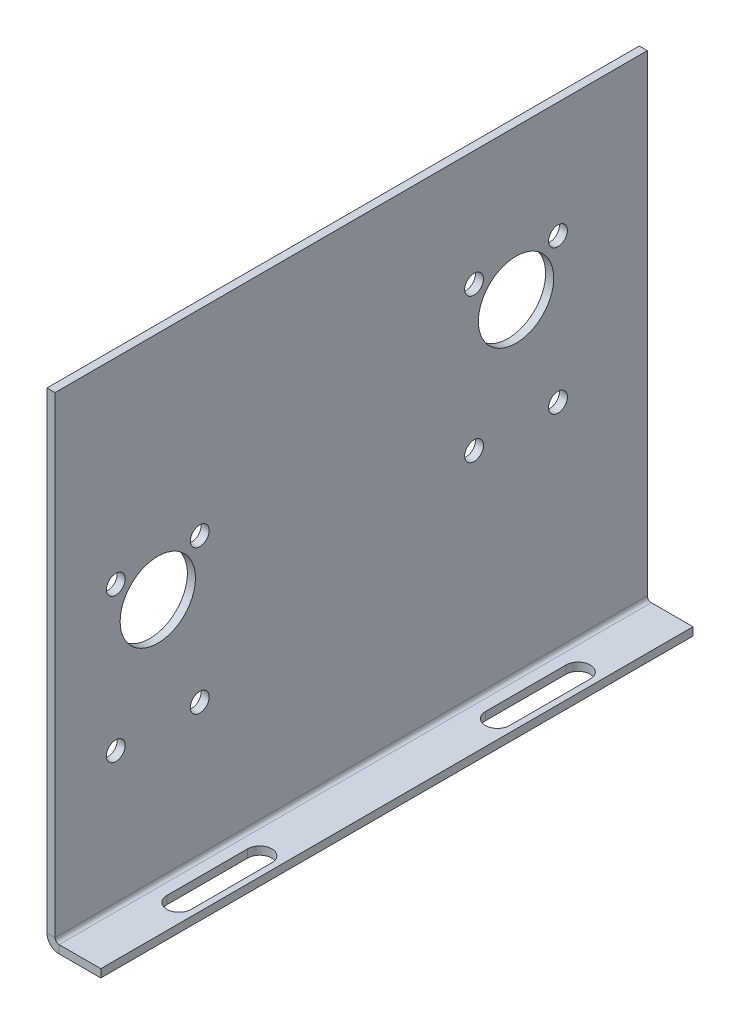
ISO-10303-21;
HEADER;
FILE_DESCRIPTION(('STEP AP214'),'2;1');
FILE_NAME('part.step','',(''),(''),'','','');
FILE_SCHEMA(('AUTOMOTIVE_DESIGN { 1 0 10303 214 1 1 1 1 }'));
ENDSEC;
DATA;
#1=APPLICATION_CONTEXT('core data for automotive mechanical design processes');
#2=APPLICATION_PROTOCOL_DEFINITION('international standard','automotive_design',2000,#1);
#3=PRODUCT_CONTEXT('',#1,'mechanical');
#4=PRODUCT('Part','Part','',(#3));
#5=PRODUCT_RELATED_PRODUCT_CATEGORY('part','',(#4));
#6=PRODUCT_DEFINITION_FORMATION('','',#4);
#7=PRODUCT_DEFINITION_CONTEXT('part definition',#1,'design');
#8=PRODUCT_DEFINITION('design','',#6,#7);
#9=PRODUCT_DEFINITION_SHAPE('','',#8);
#10=(LENGTH_UNIT() NAMED_UNIT(*) SI_UNIT(.MILLI.,.METRE.));
#11=(NAMED_UNIT(*) PLANE_ANGLE_UNIT() SI_UNIT($,.RADIAN.));
#12=(NAMED_UNIT(*) SI_UNIT($,.STERADIAN.) SOLID_ANGLE_UNIT());
#13=UNCERTAINTY_MEASURE_WITH_UNIT(LENGTH_MEASURE(1.E-05),#10,'distance_accuracy_value','');
#14=(GEOMETRIC_REPRESENTATION_CONTEXT(3) GLOBAL_UNCERTAINTY_ASSIGNED_CONTEXT((#13)) GLOBAL_UNIT_ASSIGNED_CONTEXT((#10,
#11,#12)) REPRESENTATION_CONTEXT('',''));
#15=CARTESIAN_POINT('',(0.,0.,0.));
#16=DIRECTION('',(0.,0.,1.));
#17=DIRECTION('',(1.,0.,0.));
#18=AXIS2_PLACEMENT_3D('',#15,#16,#17);
#19=CARTESIAN_POINT('',(1.5,0.,110.1));
#20=DIRECTION('',(-1.,0.,0.));
#21=DIRECTION('',(0.,0.,1.));
#22=AXIS2_PLACEMENT_3D('',#19,#20,#21);
#23=PLANE('',#22);
#24=CARTESIAN_POINT('',(1.5,62.1,24.4));
#25=DIRECTION('',(-1.,0.,0.));
#26=DIRECTION('',(0.,0.,1.));
#27=AXIS2_PLACEMENT_3D('',#24,#25,#26);
#28=CIRCLE('',#27,7.);
#29=CARTESIAN_POINT('',(1.5,62.1,31.4));
#30=VERTEX_POINT('',#29);
#31=EDGE_CURVE('E350',#30,#30,#28,.T.);
#32=ORIENTED_EDGE('',*,*,#31,.T.);
#33=EDGE_LOOP('',(#32));
#34=FACE_BOUND('',#33,.T.);
#35=CARTESIAN_POINT('',(1.5,41.7,32.2));
#36=DIRECTION('',(-1.,0.,0.));
#37=DIRECTION('',(0.,0.,1.));
#38=AXIS2_PLACEMENT_3D('',#35,#36,#37);
#39=CIRCLE('',#38,1.75);
#40=CARTESIAN_POINT('',(1.5,41.7,33.95));
#41=VERTEX_POINT('',#40);
#42=EDGE_CURVE('E318',#41,#41,#39,.T.);
#43=ORIENTED_EDGE('',*,*,#42,.T.);
#44=EDGE_LOOP('',(#43));
#45=FACE_BOUND('',#44,.T.);
#46=CARTESIAN_POINT('',(1.5,41.7,16.6));
#47=DIRECTION('',(-1.,0.,0.));
#48=DIRECTION('',(0.,0.,1.));
#49=AXIS2_PLACEMENT_3D('',#46,#47,#48);
#50=CIRCLE('',#49,1.75);
#51=CARTESIAN_POINT('',(1.5,41.7,18.35));
#52=VERTEX_POINT('',#51);
#53=EDGE_CURVE('E323',#52,#52,#50,.T.);
#54=ORIENTED_EDGE('',*,*,#53,.T.);
#55=EDGE_LOOP('',(#54));
#56=FACE_BOUND('',#55,.T.);
#57=CARTESIAN_POINT('',(1.5,68.5,16.6));
#58=DIRECTION('',(-1.,0.,0.));
#59=DIRECTION('',(0.,0.,1.));
#60=AXIS2_PLACEMENT_3D('',#57,#58,#59);
#61=CIRCLE('',#60,1.75);
#62=CARTESIAN_POINT('',(1.5,68.5,18.35));
#63=VERTEX_POINT('',#62);
#64=EDGE_CURVE('E326',#63,#63,#61,.T.);
#65=ORIENTED_EDGE('',*,*,#64,.T.);
#66=EDGE_LOOP('',(#65));
#67=FACE_BOUND('',#66,.T.);
#68=CARTESIAN_POINT('',(1.5,47.1,91.));
#69=DIRECTION('',(-1.,0.,0.));
#70=DIRECTION('',(0.,0.,1.));
#71=AXIS2_PLACEMENT_3D('',#68,#69,#70);
#72=CIRCLE('',#71,7.);
#73=CARTESIAN_POINT('',(1.5,47.1,98.));
#74=VERTEX_POINT('',#73);
#75=EDGE_CURVE('E329',#74,#74,#72,.T.);
#76=ORIENTED_EDGE('',*,*,#75,.T.);
#77=EDGE_LOOP('',(#76));
#78=FACE_BOUND('',#77,.T.);
#79=CARTESIAN_POINT('',(1.5,53.5,98.8));
#80=DIRECTION('',(-1.,0.,0.));
#81=DIRECTION('',(0.,0.,1.));
#82=AXIS2_PLACEMENT_3D('',#79,#80,#81);
#83=CIRCLE('',#82,1.75);
#84=CARTESIAN_POINT('',(1.5,53.5,100.55));
#85=VERTEX_POINT('',#84);
#86=EDGE_CURVE('E332',#85,#85,#83,.T.);
#87=ORIENTED_EDGE('',*,*,#86,.T.);
#88=EDGE_LOOP('',(#87));
#89=FACE_BOUND('',#88,.T.);
#90=CARTESIAN_POINT('',(1.5,26.7,98.8));
#91=DIRECTION('',(-1.,0.,0.));
#92=DIRECTION('',(0.,0.,1.));
#93=AXIS2_PLACEMENT_3D('',#90,#91,#92);
#94=CIRCLE('',#93,1.75);
#95=CARTESIAN_POINT('',(1.5,26.7,100.55));
#96=VERTEX_POINT('',#95);
#97=EDGE_CURVE('E335',#96,#96,#94,.T.);
#98=ORIENTED_EDGE('',*,*,#97,.T.);
#99=EDGE_LOOP('',(#98));
#100=FACE_BOUND('',#99,.T.);
#101=CARTESIAN_POINT('',(1.5,26.7,83.2));
#102=DIRECTION('',(-1.,0.,0.));
#103=DIRECTION('',(0.,0.,1.));
#104=AXIS2_PLACEMENT_3D('',#101,#102,#103);
#105=CIRCLE('',#104,1.75);
#106=CARTESIAN_POINT('',(1.5,26.7,84.95));
#107=VERTEX_POINT('',#106);
#108=EDGE_CURVE('E338',#107,#107,#105,.T.);
#109=ORIENTED_EDGE('',*,*,#108,.T.);
#110=EDGE_LOOP('',(#109));
#111=FACE_BOUND('',#110,.T.);
#112=CARTESIAN_POINT('',(1.5,53.5,83.2));
#113=DIRECTION('',(-1.,0.,0.));
#114=DIRECTION('',(0.,0.,1.));
#115=AXIS2_PLACEMENT_3D('',#112,#113,#114);
#116=CIRCLE('',#115,1.75);
#117=CARTESIAN_POINT('',(1.5,53.5,84.95));
#118=VERTEX_POINT('',#117);
#119=EDGE_CURVE('E341',#118,#118,#116,.T.);
#120=ORIENTED_EDGE('',*,*,#119,.T.);
#121=EDGE_LOOP('',(#120));
#122=FACE_BOUND('',#121,.T.);
#123=CARTESIAN_POINT('',(1.5,68.5,32.2));
#124=DIRECTION('',(-1.,0.,0.));
#125=DIRECTION('',(0.,0.,1.));
#126=AXIS2_PLACEMENT_3D('',#123,#124,#125);
#127=CIRCLE('',#126,1.75);
#128=CARTESIAN_POINT('',(1.5,68.5,33.95));
#129=VERTEX_POINT('',#128);
#130=EDGE_CURVE('E344',#129,#129,#127,.T.);
#131=ORIENTED_EDGE('',*,*,#130,.T.);
#132=EDGE_LOOP('',(#131));
#133=FACE_BOUND('',#132,.T.);
#134=DIRECTION('',(0.,0.,-1.));
#135=VECTOR('',#134,1.);
#136=CARTESIAN_POINT('',(1.5,2.2366,0.));
#137=LINE('',#136,#135);
#138=CARTESIAN_POINT('',(1.5,2.2366,0.));
#139=VERTEX_POINT('',#138);
#140=CARTESIAN_POINT('',(1.5,2.2366,110.1));
#141=VERTEX_POINT('',#140);
#142=EDGE_CURVE('E284',#139,#141,#137,.F.);
#143=ORIENTED_EDGE('',*,*,#142,.F.);
#144=DIRECTION('',(0.,1.,0.));
#145=VECTOR('',#144,1.);
#146=CARTESIAN_POINT('',(1.5,0.,0.));
#147=LINE('',#146,#145);
#148=CARTESIAN_POINT('',(1.5,90.,0.));
#149=VERTEX_POINT('',#148);
#150=EDGE_CURVE('E353',#139,#149,#147,.T.);
#151=ORIENTED_EDGE('',*,*,#150,.T.);
#152=DIRECTION('',(0.,0.,-1.));
#153=VECTOR('',#152,1.);
#154=CARTESIAN_POINT('',(1.5,90.,110.1));
#155=LINE('',#154,#153);
#156=CARTESIAN_POINT('',(1.5,90.,110.1));
#157=VERTEX_POINT('',#156);
#158=EDGE_CURVE('E13',#157,#149,#155,.T.);
#159=ORIENTED_EDGE('',*,*,#158,.F.);
#160=DIRECTION('',(0.,1.,0.));
#161=VECTOR('',#160,1.);
#162=CARTESIAN_POINT('',(1.5,0.,110.1));
#163=LINE('',#162,#161);
#164=EDGE_CURVE('E354',#141,#157,#163,.T.);
#165=ORIENTED_EDGE('',*,*,#164,.F.);
#166=EDGE_LOOP('',(#143,#151,#159,#165));
#167=FACE_BOUND('',#166,.T.);
#168=ADVANCED_FACE('F59',(#34,#45,#56,#67,#78,#89,#100,#111,#122,#133,#167),#23,.F.);
#169=CARTESIAN_POINT('',(0.,0.,110.1));
#170=DIRECTION('',(-1.,0.,0.));
#171=DIRECTION('',(0.,0.,1.));
#172=AXIS2_PLACEMENT_3D('',#169,#170,#171);
#173=PLANE('',#172);
#174=CARTESIAN_POINT('',(0.,68.5,32.2));
#175=DIRECTION('',(-1.,0.,0.));
#176=DIRECTION('',(0.,0.,-1.));
#177=AXIS2_PLACEMENT_3D('',#174,#175,#176);
#178=CIRCLE('',#177,1.75);
#179=CARTESIAN_POINT('',(0.,68.5,30.45));
#180=VERTEX_POINT('',#179);
#181=EDGE_CURVE('E303',#180,#180,#178,.T.);
#182=ORIENTED_EDGE('',*,*,#181,.F.);
#183=EDGE_LOOP('',(#182));
#184=FACE_BOUND('',#183,.T.);
#185=CARTESIAN_POINT('',(0.,53.5,83.2));
#186=DIRECTION('',(-1.,0.,0.));
#187=DIRECTION('',(0.,0.,1.));
#188=AXIS2_PLACEMENT_3D('',#185,#186,#187);
#189=CIRCLE('',#188,1.75);
#190=CARTESIAN_POINT('',(0.,53.5,84.95));
#191=VERTEX_POINT('',#190);
#192=EDGE_CURVE('E297',#191,#191,#189,.T.);
#193=ORIENTED_EDGE('',*,*,#192,.F.);
#194=EDGE_LOOP('',(#193));
#195=FACE_BOUND('',#194,.T.);
#196=CARTESIAN_POINT('',(0.,26.7,83.2));
#197=DIRECTION('',(-1.,0.,0.));
#198=DIRECTION('',(0.,0.,1.));
#199=AXIS2_PLACEMENT_3D('',#196,#197,#198);
#200=CIRCLE('',#199,1.75);
#201=CARTESIAN_POINT('',(0.,26.7,84.95));
#202=VERTEX_POINT('',#201);
#203=EDGE_CURVE('E294',#202,#202,#200,.T.);
#204=ORIENTED_EDGE('',*,*,#203,.F.);
#205=EDGE_LOOP('',(#204));
#206=FACE_BOUND('',#205,.T.);
#207=CARTESIAN_POINT('',(0.,26.7,98.8));
#208=DIRECTION('',(-1.,0.,0.));
#209=DIRECTION('',(0.,0.,-1.));
#210=AXIS2_PLACEMENT_3D('',#207,#208,#209);
#211=CIRCLE('',#210,1.75);
#212=CARTESIAN_POINT('',(0.,26.7,97.05));
#213=VERTEX_POINT('',#212);
#214=EDGE_CURVE('E298',#213,#213,#211,.T.);
#215=ORIENTED_EDGE('',*,*,#214,.F.);
#216=EDGE_LOOP('',(#215));
#217=FACE_BOUND('',#216,.T.);
#218=CARTESIAN_POINT('',(0.,53.5,98.8));
#219=DIRECTION('',(-1.,0.,0.));
#220=DIRECTION('',(0.,0.,-1.));
#221=AXIS2_PLACEMENT_3D('',#218,#219,#220);
#222=CIRCLE('',#221,1.75);
#223=CARTESIAN_POINT('',(0.,53.5,97.05));
#224=VERTEX_POINT('',#223);
#225=EDGE_CURVE('E291',#224,#224,#222,.T.);
#226=ORIENTED_EDGE('',*,*,#225,.F.);
#227=EDGE_LOOP('',(#226));
#228=FACE_BOUND('',#227,.T.);
#229=CARTESIAN_POINT('',(0.,47.1,91.));
#230=DIRECTION('',(-1.,0.,0.));
#231=DIRECTION('',(0.,0.,1.));
#232=AXIS2_PLACEMENT_3D('',#229,#230,#231);
#233=CIRCLE('',#232,7.);
#234=CARTESIAN_POINT('',(0.,47.1,98.));
#235=VERTEX_POINT('',#234);
#236=EDGE_CURVE('E315',#235,#235,#233,.T.);
#237=ORIENTED_EDGE('',*,*,#236,.F.);
#238=EDGE_LOOP('',(#237));
#239=FACE_BOUND('',#238,.T.);
#240=CARTESIAN_POINT('',(0.,68.5,16.6));
#241=DIRECTION('',(-1.,0.,0.));
#242=DIRECTION('',(0.,0.,1.));
#243=AXIS2_PLACEMENT_3D('',#240,#241,#242);
#244=CIRCLE('',#243,1.75);
#245=CARTESIAN_POINT('',(0.,68.5,18.35));
#246=VERTEX_POINT('',#245);
#247=EDGE_CURVE('E312',#246,#246,#244,.T.);
#248=ORIENTED_EDGE('',*,*,#247,.F.);
#249=EDGE_LOOP('',(#248));
#250=FACE_BOUND('',#249,.T.);
#251=CARTESIAN_POINT('',(0.,41.7,16.6));
#252=DIRECTION('',(-1.,0.,0.));
#253=DIRECTION('',(0.,0.,1.));
#254=AXIS2_PLACEMENT_3D('',#251,#252,#253);
#255=CIRCLE('',#254,1.75);
#256=CARTESIAN_POINT('',(0.,41.7,18.35));
#257=VERTEX_POINT('',#256);
#258=EDGE_CURVE('E309',#257,#257,#255,.T.);
#259=ORIENTED_EDGE('',*,*,#258,.F.);
#260=EDGE_LOOP('',(#259));
#261=FACE_BOUND('',#260,.T.);
#262=CARTESIAN_POINT('',(0.,41.7,32.2));
#263=DIRECTION('',(-1.,0.,0.));
#264=DIRECTION('',(0.,0.,-1.));
#265=AXIS2_PLACEMENT_3D('',#262,#263,#264);
#266=CIRCLE('',#265,1.75);
#267=CARTESIAN_POINT('',(0.,41.7,30.45));
#268=VERTEX_POINT('',#267);
#269=EDGE_CURVE('E306',#268,#268,#266,.T.);
#270=ORIENTED_EDGE('',*,*,#269,.F.);
#271=EDGE_LOOP('',(#270));
#272=FACE_BOUND('',#271,.T.);
#273=CARTESIAN_POINT('',(0.,62.1,24.4));
#274=DIRECTION('',(-1.,0.,0.));
#275=DIRECTION('',(0.,0.,1.));
#276=AXIS2_PLACEMENT_3D('',#273,#274,#275);
#277=CIRCLE('',#276,7.);
#278=CARTESIAN_POINT('',(0.,62.1,31.4));
#279=VERTEX_POINT('',#278);
#280=EDGE_CURVE('E347',#279,#279,#277,.T.);
#281=ORIENTED_EDGE('',*,*,#280,.F.);
#282=EDGE_LOOP('',(#281));
#283=FACE_BOUND('',#282,.T.);
#284=DIRECTION('',(0.,1.,0.));
#285=VECTOR('',#284,1.);
#286=CARTESIAN_POINT('',(0.,0.,0.));
#287=LINE('',#286,#285);
#288=CARTESIAN_POINT('',(0.,2.2366,0.));
#289=VERTEX_POINT('',#288);
#290=CARTESIAN_POINT('',(0.,90.,0.));
#291=VERTEX_POINT('',#290);
#292=EDGE_CURVE('E357',#289,#291,#287,.T.);
#293=ORIENTED_EDGE('',*,*,#292,.F.);
#294=DIRECTION('',(0.,0.,-1.));
#295=VECTOR('',#294,1.);
#296=CARTESIAN_POINT('',(0.,2.2366,0.));
#297=LINE('',#296,#295);
#298=CARTESIAN_POINT('',(0.,2.2366,110.1));
#299=VERTEX_POINT('',#298);
#300=EDGE_CURVE('E271',#289,#299,#297,.F.);
#301=ORIENTED_EDGE('',*,*,#300,.T.);
#302=DIRECTION('',(0.,1.,0.));
#303=VECTOR('',#302,1.);
#304=CARTESIAN_POINT('',(0.,0.,110.1));
#305=LINE('',#304,#303);
#306=CARTESIAN_POINT('',(0.,90.,110.1));
#307=VERTEX_POINT('',#306);
#308=EDGE_CURVE('E360',#299,#307,#305,.T.);
#309=ORIENTED_EDGE('',*,*,#308,.T.);
#310=DIRECTION('',(0.,0.,-1.));
#311=VECTOR('',#310,1.);
#312=CARTESIAN_POINT('',(0.,90.,110.1));
#313=LINE('',#312,#311);
#314=EDGE_CURVE('E66',#307,#291,#313,.T.);
#315=ORIENTED_EDGE('',*,*,#314,.T.);
#316=EDGE_LOOP('',(#293,#301,#309,#315));
#317=FACE_BOUND('',#316,.T.);
#318=ADVANCED_FACE('F371',(#184,#195,#206,#217,#228,#239,#250,#261,#272,#283,#317),#173,.T.);
#319=CARTESIAN_POINT('',(0.,0.,110.1));
#320=DIRECTION('',(0.,0.,-1.));
#321=DIRECTION('',(-1.,0.,0.));
#322=AXIS2_PLACEMENT_3D('',#319,#320,#321);
#323=PLANE('',#322);
#324=DIRECTION('',(-1.,0.,0.));
#325=VECTOR('',#324,1.);
#326=CARTESIAN_POINT('',(1.5,2.2366,110.1));
#327=LINE('',#326,#325);
#328=EDGE_CURVE('E288',#141,#299,#327,.T.);
#329=ORIENTED_EDGE('',*,*,#328,.F.);
#330=ORIENTED_EDGE('',*,*,#164,.T.);
#331=DIRECTION('',(1.,0.,0.));
#332=VECTOR('',#331,1.);
#333=CARTESIAN_POINT('',(0.,90.,110.1));
#334=LINE('',#333,#332);
#335=EDGE_CURVE('E356',#307,#157,#334,.T.);
#336=ORIENTED_EDGE('',*,*,#335,.F.);
#337=ORIENTED_EDGE('',*,*,#308,.F.);
#338=EDGE_LOOP('',(#329,#330,#336,#337));
#339=FACE_BOUND('',#338,.T.);
#340=ADVANCED_FACE('F393',(#339),#323,.F.);
#341=CARTESIAN_POINT('',(0.,0.,0.));
#342=DIRECTION('',(0.,0.,-1.));
#343=DIRECTION('',(-1.,0.,0.));
#344=AXIS2_PLACEMENT_3D('',#341,#342,#343);
#345=PLANE('',#344);
#346=ORIENTED_EDGE('',*,*,#150,.F.);
#347=DIRECTION('',(-1.,0.,0.));
#348=VECTOR('',#347,1.);
#349=CARTESIAN_POINT('',(1.5,2.2366,0.));
#350=LINE('',#349,#348);
#351=EDGE_CURVE('E278',#139,#289,#350,.T.);
#352=ORIENTED_EDGE('',*,*,#351,.T.);
#353=ORIENTED_EDGE('',*,*,#292,.T.);
#354=DIRECTION('',(1.,0.,0.));
#355=VECTOR('',#354,1.);
#356=CARTESIAN_POINT('',(0.,90.,0.));
#357=LINE('',#356,#355);
#358=EDGE_CURVE('E363',#291,#149,#357,.T.);
#359=ORIENTED_EDGE('',*,*,#358,.T.);
#360=EDGE_LOOP('',(#346,#352,#353,#359));
#361=FACE_BOUND('',#360,.T.);
#362=ADVANCED_FACE('F379',(#361),#345,.T.);
#363=CARTESIAN_POINT('',(0.,90.,110.1));
#364=DIRECTION('',(0.,1.,0.));
#365=DIRECTION('',(0.,0.,1.));
#366=AXIS2_PLACEMENT_3D('',#363,#364,#365);
#367=PLANE('',#366);
#368=ORIENTED_EDGE('',*,*,#358,.F.);
#369=ORIENTED_EDGE('',*,*,#314,.F.);
#370=ORIENTED_EDGE('',*,*,#335,.T.);
#371=ORIENTED_EDGE('',*,*,#158,.T.);
#372=EDGE_LOOP('',(#368,#369,#370,#371));
#373=FACE_BOUND('',#372,.T.);
#374=ADVANCED_FACE('F375',(#373),#367,.T.);
#375=CARTESIAN_POINT('',(10.,62.1,24.4));
#376=DIRECTION('',(-1.,0.,0.));
#377=DIRECTION('',(0.,0.,1.));
#378=AXIS2_PLACEMENT_3D('',#375,#376,#377);
#379=CYLINDRICAL_SURFACE('',#378,7.);
#380=ORIENTED_EDGE('',*,*,#280,.T.);
#381=EDGE_LOOP('',(#380));
#382=FACE_BOUND('',#381,.T.);
#383=ORIENTED_EDGE('',*,*,#31,.F.);
#384=EDGE_LOOP('',(#383));
#385=FACE_BOUND('',#384,.T.);
#386=ADVANCED_FACE('F479',(#382,#385),#379,.F.);
#387=CARTESIAN_POINT('',(10.,41.7,32.2));
#388=DIRECTION('',(-1.,0.,0.));
#389=DIRECTION('',(0.,0.,1.));
#390=AXIS2_PLACEMENT_3D('',#387,#388,#389);
#391=CYLINDRICAL_SURFACE('',#390,1.75);
#392=ORIENTED_EDGE('',*,*,#269,.T.);
#393=EDGE_LOOP('',(#392));
#394=FACE_BOUND('',#393,.T.);
#395=ORIENTED_EDGE('',*,*,#42,.F.);
#396=EDGE_LOOP('',(#395));
#397=FACE_BOUND('',#396,.T.);
#398=ADVANCED_FACE('F475',(#394,#397),#391,.F.);
#399=CARTESIAN_POINT('',(10.,41.7,16.6));
#400=DIRECTION('',(-1.,0.,0.));
#401=DIRECTION('',(0.,0.,1.));
#402=AXIS2_PLACEMENT_3D('',#399,#400,#401);
#403=CYLINDRICAL_SURFACE('',#402,1.75);
#404=ORIENTED_EDGE('',*,*,#258,.T.);
#405=EDGE_LOOP('',(#404));
#406=FACE_BOUND('',#405,.T.);
#407=ORIENTED_EDGE('',*,*,#53,.F.);
#408=EDGE_LOOP('',(#407));
#409=FACE_BOUND('',#408,.T.);
#410=ADVANCED_FACE('F471',(#406,#409),#403,.F.);
#411=CARTESIAN_POINT('',(10.,68.5,16.6));
#412=DIRECTION('',(-1.,0.,0.));
#413=DIRECTION('',(0.,0.,1.));
#414=AXIS2_PLACEMENT_3D('',#411,#412,#413);
#415=CYLINDRICAL_SURFACE('',#414,1.75);
#416=ORIENTED_EDGE('',*,*,#247,.T.);
#417=EDGE_LOOP('',(#416));
#418=FACE_BOUND('',#417,.T.);
#419=ORIENTED_EDGE('',*,*,#64,.F.);
#420=EDGE_LOOP('',(#419));
#421=FACE_BOUND('',#420,.T.);
#422=ADVANCED_FACE('F474',(#418,#421),#415,.F.);
#423=CARTESIAN_POINT('',(10.,47.1,91.));
#424=DIRECTION('',(-1.,0.,0.));
#425=DIRECTION('',(0.,0.,1.));
#426=AXIS2_PLACEMENT_3D('',#423,#424,#425);
#427=CYLINDRICAL_SURFACE('',#426,7.);
#428=ORIENTED_EDGE('',*,*,#236,.T.);
#429=EDGE_LOOP('',(#428));
#430=FACE_BOUND('',#429,.T.);
#431=ORIENTED_EDGE('',*,*,#75,.F.);
#432=EDGE_LOOP('',(#431));
#433=FACE_BOUND('',#432,.T.);
#434=ADVANCED_FACE('F481',(#430,#433),#427,.F.);
#435=CARTESIAN_POINT('',(10.,53.5,98.8));
#436=DIRECTION('',(-1.,0.,0.));
#437=DIRECTION('',(0.,0.,1.));
#438=AXIS2_PLACEMENT_3D('',#435,#436,#437);
#439=CYLINDRICAL_SURFACE('',#438,1.75);
#440=ORIENTED_EDGE('',*,*,#225,.T.);
#441=EDGE_LOOP('',(#440));
#442=FACE_BOUND('',#441,.T.);
#443=ORIENTED_EDGE('',*,*,#86,.F.);
#444=EDGE_LOOP('',(#443));
#445=FACE_BOUND('',#444,.T.);
#446=ADVANCED_FACE('F468',(#442,#445),#439,.F.);
#447=CARTESIAN_POINT('',(10.,26.7,98.8));
#448=DIRECTION('',(-1.,0.,0.));
#449=DIRECTION('',(0.,0.,1.));
#450=AXIS2_PLACEMENT_3D('',#447,#448,#449);
#451=CYLINDRICAL_SURFACE('',#450,1.75);
#452=ORIENTED_EDGE('',*,*,#214,.T.);
#453=EDGE_LOOP('',(#452));
#454=FACE_BOUND('',#453,.T.);
#455=ORIENTED_EDGE('',*,*,#97,.F.);
#456=EDGE_LOOP('',(#455));
#457=FACE_BOUND('',#456,.T.);
#458=ADVANCED_FACE('F525',(#454,#457),#451,.F.);
#459=CARTESIAN_POINT('',(10.,26.7,83.2));
#460=DIRECTION('',(-1.,0.,0.));
#461=DIRECTION('',(0.,0.,1.));
#462=AXIS2_PLACEMENT_3D('',#459,#460,#461);
#463=CYLINDRICAL_SURFACE('',#462,1.75);
#464=ORIENTED_EDGE('',*,*,#203,.T.);
#465=EDGE_LOOP('',(#464));
#466=FACE_BOUND('',#465,.T.);
#467=ORIENTED_EDGE('',*,*,#108,.F.);
#468=EDGE_LOOP('',(#467));
#469=FACE_BOUND('',#468,.T.);
#470=ADVANCED_FACE('F464',(#466,#469),#463,.F.);
#471=CARTESIAN_POINT('',(10.,53.5,83.2));
#472=DIRECTION('',(-1.,0.,0.));
#473=DIRECTION('',(0.,0.,1.));
#474=AXIS2_PLACEMENT_3D('',#471,#472,#473);
#475=CYLINDRICAL_SURFACE('',#474,1.75);
#476=ORIENTED_EDGE('',*,*,#192,.T.);
#477=EDGE_LOOP('',(#476));
#478=FACE_BOUND('',#477,.T.);
#479=ORIENTED_EDGE('',*,*,#119,.F.);
#480=EDGE_LOOP('',(#479));
#481=FACE_BOUND('',#480,.T.);
#482=ADVANCED_FACE('F456',(#478,#481),#475,.F.);
#483=CARTESIAN_POINT('',(10.,68.5,32.2));
#484=DIRECTION('',(-1.,0.,0.));
#485=DIRECTION('',(0.,0.,1.));
#486=AXIS2_PLACEMENT_3D('',#483,#484,#485);
#487=CYLINDRICAL_SURFACE('',#486,1.75);
#488=ORIENTED_EDGE('',*,*,#181,.T.);
#489=EDGE_LOOP('',(#488));
#490=FACE_BOUND('',#489,.T.);
#491=ORIENTED_EDGE('',*,*,#130,.F.);
#492=EDGE_LOOP('',(#491));
#493=FACE_BOUND('',#492,.T.);
#494=ADVANCED_FACE('F454',(#490,#493),#487,.F.);
#495=CARTESIAN_POINT('',(2.2366,2.2366,110.1));
#496=DIRECTION('',(0.,0.,1.));
#497=DIRECTION('',(1.,0.,0.));
#498=AXIS2_PLACEMENT_3D('',#495,#496,#497);
#499=PLANE('',#498);
#500=DIRECTION('',(0.,1.,0.));
#501=VECTOR('',#500,1.);
#502=CARTESIAN_POINT('',(2.23659999999999,0.,110.1));
#503=LINE('',#502,#501);
#504=CARTESIAN_POINT('',(2.2366,1.5,110.1));
#505=VERTEX_POINT('',#504);
#506=CARTESIAN_POINT('',(2.23659999999999,0.,110.1));
#507=VERTEX_POINT('',#506);
#508=EDGE_CURVE('E240',#505,#507,#503,.F.);
#509=ORIENTED_EDGE('',*,*,#508,.F.);
#510=CARTESIAN_POINT('',(2.2366,2.2366,110.1));
#511=DIRECTION('',(0.,0.,-1.));
#512=DIRECTION('',(-1.,0.,0.));
#513=AXIS2_PLACEMENT_3D('',#510,#511,#512);
#514=CIRCLE('',#513,0.7366);
#515=EDGE_CURVE('E281',#141,#505,#514,.F.);
#516=ORIENTED_EDGE('',*,*,#515,.F.);
#517=ORIENTED_EDGE('',*,*,#328,.T.);
#518=CARTESIAN_POINT('',(2.2366,2.2366,110.1));
#519=DIRECTION('',(0.,0.,-1.));
#520=DIRECTION('',(-1.,0.,0.));
#521=AXIS2_PLACEMENT_3D('',#518,#519,#520);
#522=CIRCLE('',#521,2.2366);
#523=EDGE_CURVE('E274',#299,#507,#522,.F.);
#524=ORIENTED_EDGE('',*,*,#523,.T.);
#525=EDGE_LOOP('',(#509,#516,#517,#524));
#526=FACE_BOUND('',#525,.T.);
#527=ADVANCED_FACE('F395',(#526),#499,.T.);
#528=CARTESIAN_POINT('',(2.2366,2.2366,0.));
#529=DIRECTION('',(0.,0.,1.));
#530=DIRECTION('',(1.,0.,0.));
#531=AXIS2_PLACEMENT_3D('',#528,#529,#530);
#532=PLANE('',#531);
#533=CARTESIAN_POINT('',(2.2366,2.2366,0.));
#534=DIRECTION('',(0.,0.,-1.));
#535=DIRECTION('',(-1.,0.,0.));
#536=AXIS2_PLACEMENT_3D('',#533,#534,#535);
#537=CIRCLE('',#536,0.7366);
#538=CARTESIAN_POINT('',(2.2366,1.5,0.));
#539=VERTEX_POINT('',#538);
#540=EDGE_CURVE('E244',#539,#139,#537,.T.);
#541=ORIENTED_EDGE('',*,*,#540,.F.);
#542=DIRECTION('',(0.,1.,0.));
#543=VECTOR('',#542,1.);
#544=CARTESIAN_POINT('',(2.2366,1.5,0.));
#545=LINE('',#544,#543);
#546=CARTESIAN_POINT('',(2.23659999999999,0.,0.));
#547=VERTEX_POINT('',#546);
#548=EDGE_CURVE('E264',#539,#547,#545,.F.);
#549=ORIENTED_EDGE('',*,*,#548,.T.);
#550=CARTESIAN_POINT('',(2.2366,2.2366,0.));
#551=DIRECTION('',(0.,0.,-1.));
#552=DIRECTION('',(-1.,0.,0.));
#553=AXIS2_PLACEMENT_3D('',#550,#551,#552);
#554=CIRCLE('',#553,2.2366);
#555=EDGE_CURVE('E275',#547,#289,#554,.T.);
#556=ORIENTED_EDGE('',*,*,#555,.T.);
#557=ORIENTED_EDGE('',*,*,#351,.F.);
#558=EDGE_LOOP('',(#541,#549,#556,#557));
#559=FACE_BOUND('',#558,.T.);
#560=ADVANCED_FACE('F382',(#559),#532,.F.);
#561=CARTESIAN_POINT('',(2.2366,2.2366,0.));
#562=DIRECTION('',(0.,0.,-1.));
#563=DIRECTION('',(0.,-1.,0.));
#564=AXIS2_PLACEMENT_3D('',#561,#562,#563);
#565=CYLINDRICAL_SURFACE('',#564,2.2366);
#566=ORIENTED_EDGE('',*,*,#300,.F.);
#567=ORIENTED_EDGE('',*,*,#555,.F.);
#568=DIRECTION('',(0.,0.,-1.));
#569=VECTOR('',#568,1.);
#570=CARTESIAN_POINT('',(2.23659999999999,0.,110.1));
#571=LINE('',#570,#569);
#572=EDGE_CURVE('E262',#547,#507,#571,.F.);
#573=ORIENTED_EDGE('',*,*,#572,.T.);
#574=ORIENTED_EDGE('',*,*,#523,.F.);
#575=EDGE_LOOP('',(#566,#567,#573,#574));
#576=FACE_BOUND('',#575,.T.);
#577=ADVANCED_FACE('F397',(#576),#565,.T.);
#578=CARTESIAN_POINT('',(2.2366,2.2366,0.));
#579=DIRECTION('',(0.,0.,-1.));
#580=DIRECTION('',(0.,-1.,0.));
#581=AXIS2_PLACEMENT_3D('',#578,#579,#580);
#582=CYLINDRICAL_SURFACE('',#581,0.7366);
#583=ORIENTED_EDGE('',*,*,#142,.T.);
#584=ORIENTED_EDGE('',*,*,#515,.T.);
#585=DIRECTION('',(0.,0.,-1.));
#586=VECTOR('',#585,1.);
#587=CARTESIAN_POINT('',(2.2366,1.5,110.1));
#588=LINE('',#587,#586);
#589=EDGE_CURVE('E267',#505,#539,#588,.T.);
#590=ORIENTED_EDGE('',*,*,#589,.T.);
#591=ORIENTED_EDGE('',*,*,#540,.T.);
#592=EDGE_LOOP('',(#583,#584,#590,#591));
#593=FACE_BOUND('',#592,.T.);
#594=ADVANCED_FACE('F386',(#593),#582,.F.);
#595=CARTESIAN_POINT('',(10.,0.,0.));
#596=DIRECTION('',(0.,0.,1.));
#597=DIRECTION('',(1.,0.,0.));
#598=AXIS2_PLACEMENT_3D('',#595,#596,#597);
#599=PLANE('',#598);
#600=ORIENTED_EDGE('',*,*,#548,.F.);
#601=DIRECTION('',(-1.,0.,0.));
#602=VECTOR('',#601,1.);
#603=CARTESIAN_POINT('',(10.,1.49999999999997,0.));
#604=LINE('',#603,#602);
#605=CARTESIAN_POINT('',(10.,1.49999999999997,0.));
#606=VERTEX_POINT('',#605);
#607=EDGE_CURVE('E260',#539,#606,#604,.F.);
#608=ORIENTED_EDGE('',*,*,#607,.T.);
#609=DIRECTION('',(0.,1.,0.));
#610=VECTOR('',#609,1.);
#611=CARTESIAN_POINT('',(10.,0.,0.));
#612=LINE('',#611,#610);
#613=CARTESIAN_POINT('',(10.,0.,0.));
#614=VERTEX_POINT('',#613);
#615=EDGE_CURVE('E241',#614,#606,#612,.T.);
#616=ORIENTED_EDGE('',*,*,#615,.F.);
#617=DIRECTION('',(1.,0.,0.));
#618=VECTOR('',#617,1.);
#619=CARTESIAN_POINT('',(0.,0.,0.));
#620=LINE('',#619,#618);
#621=EDGE_CURVE('E253',#547,#614,#620,.T.);
#622=ORIENTED_EDGE('',*,*,#621,.F.);
#623=EDGE_LOOP('',(#600,#608,#616,#622));
#624=FACE_BOUND('',#623,.T.);
#625=ADVANCED_FACE('F405',(#624),#599,.F.);
#626=CARTESIAN_POINT('',(1.49999999999999,0.,110.1));
#627=DIRECTION('',(0.,0.,-1.));
#628=DIRECTION('',(-1.,0.,0.));
#629=AXIS2_PLACEMENT_3D('',#626,#627,#628);
#630=PLANE('',#629);
#631=ORIENTED_EDGE('',*,*,#508,.T.);
#632=DIRECTION('',(-1.,0.,0.));
#633=VECTOR('',#632,1.);
#634=CARTESIAN_POINT('',(0.,0.,110.1));
#635=LINE('',#634,#633);
#636=CARTESIAN_POINT('',(10.,0.,110.1));
#637=VERTEX_POINT('',#636);
#638=EDGE_CURVE('E248',#637,#507,#635,.T.);
#639=ORIENTED_EDGE('',*,*,#638,.F.);
#640=DIRECTION('',(0.,1.,0.));
#641=VECTOR('',#640,1.);
#642=CARTESIAN_POINT('',(10.,0.,110.1));
#643=LINE('',#642,#641);
#644=CARTESIAN_POINT('',(10.,1.49999999999997,110.1));
#645=VERTEX_POINT('',#644);
#646=EDGE_CURVE('E245',#637,#645,#643,.T.);
#647=ORIENTED_EDGE('',*,*,#646,.T.);
#648=DIRECTION('',(1.,0.,0.));
#649=VECTOR('',#648,1.);
#650=CARTESIAN_POINT('',(1.5,1.5,110.1));
#651=LINE('',#650,#649);
#652=EDGE_CURVE('E255',#645,#505,#651,.F.);
#653=ORIENTED_EDGE('',*,*,#652,.T.);
#654=EDGE_LOOP('',(#631,#639,#647,#653));
#655=FACE_BOUND('',#654,.T.);
#656=ADVANCED_FACE('F414',(#655),#630,.F.);
#657=CARTESIAN_POINT('',(0.,0.,0.));
#658=DIRECTION('',(0.,1.,0.));
#659=DIRECTION('',(-1.,0.,0.));
#660=AXIS2_PLACEMENT_3D('',#657,#658,#659);
#661=PLANE('',#660);
#662=DIRECTION('',(0.,0.,1.));
#663=VECTOR('',#662,1.);
#664=CARTESIAN_POINT('',(4.34999999999999,0.,0.));
#665=LINE('',#664,#663);
#666=CARTESIAN_POINT('',(4.34999999999999,0.,77.15));
#667=VERTEX_POINT('',#666);
#668=CARTESIAN_POINT('',(4.34999999999999,0.,92.15));
#669=VERTEX_POINT('',#668);
#670=EDGE_CURVE('E202',#667,#669,#665,.T.);
#671=ORIENTED_EDGE('',*,*,#670,.T.);
#672=CARTESIAN_POINT('',(6.6,0.,92.15));
#673=DIRECTION('',(0.,1.,0.));
#674=DIRECTION('',(-1.,0.,0.));
#675=AXIS2_PLACEMENT_3D('',#672,#673,#674);
#676=CIRCLE('',#675,2.25);
#677=CARTESIAN_POINT('',(8.85,0.,92.15));
#678=VERTEX_POINT('',#677);
#679=EDGE_CURVE('E205',#669,#678,#676,.T.);
#680=ORIENTED_EDGE('',*,*,#679,.T.);
#681=DIRECTION('',(0.,0.,-1.));
#682=VECTOR('',#681,1.);
#683=CARTESIAN_POINT('',(8.84999999999998,0.,0.));
#684=LINE('',#683,#682);
#685=CARTESIAN_POINT('',(8.85,0.,77.15));
#686=VERTEX_POINT('',#685);
#687=EDGE_CURVE('E197',#678,#686,#684,.T.);
#688=ORIENTED_EDGE('',*,*,#687,.T.);
#689=CARTESIAN_POINT('',(6.6,0.,77.1499999126885));
#690=DIRECTION('',(0.,1.,0.));
#691=DIRECTION('',(-1.,0.,0.));
#692=AXIS2_PLACEMENT_3D('',#689,#690,#691);
#693=CIRCLE('',#692,2.25);
#694=EDGE_CURVE('E177',#686,#667,#693,.T.);
#695=ORIENTED_EDGE('',*,*,#694,.T.);
#696=EDGE_LOOP('',(#671,#680,#688,#695));
#697=FACE_BOUND('',#696,.T.);
#698=DIRECTION('',(0.,0.,-1.));
#699=VECTOR('',#698,1.);
#700=CARTESIAN_POINT('',(8.84999999999999,0.,0.));
#701=LINE('',#700,#699);
#702=CARTESIAN_POINT('',(8.84999999999999,0.,32.95));
#703=VERTEX_POINT('',#702);
#704=CARTESIAN_POINT('',(8.84999999999999,0.,17.95));
#705=VERTEX_POINT('',#704);
#706=EDGE_CURVE('E234',#703,#705,#701,.T.);
#707=ORIENTED_EDGE('',*,*,#706,.T.);
#708=CARTESIAN_POINT('',(6.59999999999999,0.,17.950000154003));
#709=DIRECTION('',(0.,1.,0.));
#710=DIRECTION('',(-1.,0.,0.));
#711=AXIS2_PLACEMENT_3D('',#708,#709,#710);
#712=CIRCLE('',#711,2.25000000000001);
#713=CARTESIAN_POINT('',(4.34999999999999,0.,17.95));
#714=VERTEX_POINT('',#713);
#715=EDGE_CURVE('E237',#705,#714,#712,.T.);
#716=ORIENTED_EDGE('',*,*,#715,.T.);
#717=DIRECTION('',(0.,0.,1.));
#718=VECTOR('',#717,1.);
#719=CARTESIAN_POINT('',(4.34999999999998,0.,0.));
#720=LINE('',#719,#718);
#721=CARTESIAN_POINT('',(4.34999999999999,0.,32.95));
#722=VERTEX_POINT('',#721);
#723=EDGE_CURVE('E222',#714,#722,#720,.T.);
#724=ORIENTED_EDGE('',*,*,#723,.T.);
#725=CARTESIAN_POINT('',(6.59999999999999,0.,32.95));
#726=DIRECTION('',(0.,1.,0.));
#727=DIRECTION('',(-1.,0.,0.));
#728=AXIS2_PLACEMENT_3D('',#725,#726,#727);
#729=CIRCLE('',#728,2.25);
#730=EDGE_CURVE('E231',#722,#703,#729,.T.);
#731=ORIENTED_EDGE('',*,*,#730,.T.);
#732=EDGE_LOOP('',(#707,#716,#724,#731));
#733=FACE_BOUND('',#732,.T.);
#734=ORIENTED_EDGE('',*,*,#572,.F.);
#735=ORIENTED_EDGE('',*,*,#621,.T.);
#736=DIRECTION('',(0.,0.,1.));
#737=VECTOR('',#736,1.);
#738=CARTESIAN_POINT('',(10.,0.,0.));
#739=LINE('',#738,#737);
#740=EDGE_CURVE('E251',#614,#637,#739,.T.);
#741=ORIENTED_EDGE('',*,*,#740,.T.);
#742=ORIENTED_EDGE('',*,*,#638,.T.);
#743=EDGE_LOOP('',(#734,#735,#741,#742));
#744=FACE_BOUND('',#743,.T.);
#745=ADVANCED_FACE('F401',(#697,#733,#744),#661,.F.);
#746=CARTESIAN_POINT('',(0.,1.50000000000001,0.));
#747=DIRECTION('',(0.,1.,0.));
#748=DIRECTION('',(-1.,0.,0.));
#749=AXIS2_PLACEMENT_3D('',#746,#747,#748);
#750=PLANE('',#749);
#751=CARTESIAN_POINT('',(6.6,1.49999999999998,92.15));
#752=DIRECTION('',(0.,1.,0.));
#753=DIRECTION('',(-1.,0.,0.));
#754=AXIS2_PLACEMENT_3D('',#751,#752,#753);
#755=CIRCLE('',#754,2.25);
#756=CARTESIAN_POINT('',(4.35,1.49999999999999,92.15));
#757=VERTEX_POINT('',#756);
#758=CARTESIAN_POINT('',(8.85,1.49999999999997,92.15));
#759=VERTEX_POINT('',#758);
#760=EDGE_CURVE('E81',#757,#759,#755,.T.);
#761=ORIENTED_EDGE('',*,*,#760,.F.);
#762=DIRECTION('',(0.,0.,1.));
#763=VECTOR('',#762,1.);
#764=CARTESIAN_POINT('',(4.35,1.49999999999999,92.15));
#765=LINE('',#764,#763);
#766=CARTESIAN_POINT('',(4.35,1.49999999999999,77.15));
#767=VERTEX_POINT('',#766);
#768=EDGE_CURVE('E190',#767,#757,#765,.T.);
#769=ORIENTED_EDGE('',*,*,#768,.F.);
#770=CARTESIAN_POINT('',(6.6,1.49999999999998,77.1499999126885));
#771=DIRECTION('',(0.,1.,0.));
#772=DIRECTION('',(-1.,0.,0.));
#773=AXIS2_PLACEMENT_3D('',#770,#771,#772);
#774=CIRCLE('',#773,2.25);
#775=CARTESIAN_POINT('',(8.85,1.49999999999997,77.15));
#776=VERTEX_POINT('',#775);
#777=EDGE_CURVE('E174',#776,#767,#774,.T.);
#778=ORIENTED_EDGE('',*,*,#777,.F.);
#779=DIRECTION('',(0.,0.,-1.));
#780=VECTOR('',#779,1.);
#781=CARTESIAN_POINT('',(8.85,1.49999999999997,92.15));
#782=LINE('',#781,#780);
#783=EDGE_CURVE('E183',#759,#776,#782,.T.);
#784=ORIENTED_EDGE('',*,*,#783,.F.);
#785=EDGE_LOOP('',(#761,#769,#778,#784));
#786=FACE_BOUND('',#785,.T.);
#787=CARTESIAN_POINT('',(6.59999999999999,1.49999999999998,17.950000154003));
#788=DIRECTION('',(0.,1.,0.));
#789=DIRECTION('',(-1.,0.,0.));
#790=AXIS2_PLACEMENT_3D('',#787,#788,#789);
#791=CIRCLE('',#790,2.25000000000001);
#792=CARTESIAN_POINT('',(8.84999999999999,1.49999999999997,17.95));
#793=VERTEX_POINT('',#792);
#794=CARTESIAN_POINT('',(4.34999999999999,1.49999999999999,17.95));
#795=VERTEX_POINT('',#794);
#796=EDGE_CURVE('E208',#793,#795,#791,.T.);
#797=ORIENTED_EDGE('',*,*,#796,.F.);
#798=DIRECTION('',(0.,0.,-1.));
#799=VECTOR('',#798,1.);
#800=CARTESIAN_POINT('',(8.84999999999999,1.49999999999997,17.95));
#801=LINE('',#800,#799);
#802=CARTESIAN_POINT('',(8.84999999999999,1.49999999999997,32.95));
#803=VERTEX_POINT('',#802);
#804=EDGE_CURVE('E216',#803,#793,#801,.T.);
#805=ORIENTED_EDGE('',*,*,#804,.F.);
#806=CARTESIAN_POINT('',(6.59999999999999,1.49999999999998,32.95));
#807=DIRECTION('',(0.,1.,0.));
#808=DIRECTION('',(-1.,0.,0.));
#809=AXIS2_PLACEMENT_3D('',#806,#807,#808);
#810=CIRCLE('',#809,2.25);
#811=CARTESIAN_POINT('',(4.34999999999999,1.49999999999999,32.95));
#812=VERTEX_POINT('',#811);
#813=EDGE_CURVE('E213',#812,#803,#810,.T.);
#814=ORIENTED_EDGE('',*,*,#813,.F.);
#815=DIRECTION('',(0.,0.,1.));
#816=VECTOR('',#815,1.);
#817=CARTESIAN_POINT('',(4.34999999999999,1.49999999999999,17.95));
#818=LINE('',#817,#816);
#819=EDGE_CURVE('E210',#795,#812,#818,.T.);
#820=ORIENTED_EDGE('',*,*,#819,.F.);
#821=EDGE_LOOP('',(#797,#805,#814,#820));
#822=FACE_BOUND('',#821,.T.);
#823=ORIENTED_EDGE('',*,*,#607,.F.);
#824=ORIENTED_EDGE('',*,*,#589,.F.);
#825=ORIENTED_EDGE('',*,*,#652,.F.);
#826=DIRECTION('',(0.,0.,-1.));
#827=VECTOR('',#826,1.);
#828=CARTESIAN_POINT('',(10.,1.49999999999997,110.1));
#829=LINE('',#828,#827);
#830=EDGE_CURVE('E258',#606,#645,#829,.F.);
#831=ORIENTED_EDGE('',*,*,#830,.F.);
#832=EDGE_LOOP('',(#823,#824,#825,#831));
#833=FACE_BOUND('',#832,.T.);
#834=ADVANCED_FACE('F187',(#786,#822,#833),#750,.T.);
#835=CARTESIAN_POINT('',(10.,0.,110.1));
#836=DIRECTION('',(-1.,0.,0.));
#837=DIRECTION('',(0.,-1.,0.));
#838=AXIS2_PLACEMENT_3D('',#835,#836,#837);
#839=PLANE('',#838);
#840=ORIENTED_EDGE('',*,*,#830,.T.);
#841=ORIENTED_EDGE('',*,*,#646,.F.);
#842=ORIENTED_EDGE('',*,*,#740,.F.);
#843=ORIENTED_EDGE('',*,*,#615,.T.);
#844=EDGE_LOOP('',(#840,#841,#842,#843));
#845=FACE_BOUND('',#844,.T.);
#846=ADVANCED_FACE('F411',(#845),#839,.F.);
#847=CARTESIAN_POINT('',(6.59999999999996,-8.50000000000002,17.950000154003));
#848=DIRECTION('',(0.,1.,0.));
#849=DIRECTION('',(-1.,0.,0.));
#850=AXIS2_PLACEMENT_3D('',#847,#848,#849);
#851=CYLINDRICAL_SURFACE('',#850,2.25000000000001);
#852=DIRECTION('',(0.,1.,0.));
#853=VECTOR('',#852,1.);
#854=CARTESIAN_POINT('',(8.84999999999996,-8.50000000000002,17.95));
#855=LINE('',#854,#853);
#856=EDGE_CURVE('E220',#705,#793,#855,.T.);
#857=ORIENTED_EDGE('',*,*,#856,.T.);
#858=ORIENTED_EDGE('',*,*,#796,.T.);
#859=DIRECTION('',(0.,1.,0.));
#860=VECTOR('',#859,1.);
#861=CARTESIAN_POINT('',(4.34999999999996,-8.50000000000001,17.95));
#862=LINE('',#861,#860);
#863=EDGE_CURVE('E219',#714,#795,#862,.T.);
#864=ORIENTED_EDGE('',*,*,#863,.F.);
#865=ORIENTED_EDGE('',*,*,#715,.F.);
#866=EDGE_LOOP('',(#857,#858,#864,#865));
#867=FACE_BOUND('',#866,.T.);
#868=ADVANCED_FACE('F422',(#867),#851,.F.);
#869=CARTESIAN_POINT('',(8.84999999999996,-8.50000000000002,17.95));
#870=DIRECTION('',(1.,0.,0.));
#871=DIRECTION('',(0.,1.,0.));
#872=AXIS2_PLACEMENT_3D('',#869,#870,#871);
#873=PLANE('',#872);
#874=DIRECTION('',(0.,1.,0.));
#875=VECTOR('',#874,1.);
#876=CARTESIAN_POINT('',(8.84999999999996,-8.50000000000002,32.95));
#877=LINE('',#876,#875);
#878=EDGE_CURVE('E223',#703,#803,#877,.T.);
#879=ORIENTED_EDGE('',*,*,#878,.T.);
#880=ORIENTED_EDGE('',*,*,#804,.T.);
#881=ORIENTED_EDGE('',*,*,#856,.F.);
#882=ORIENTED_EDGE('',*,*,#706,.F.);
#883=EDGE_LOOP('',(#879,#880,#881,#882));
#884=FACE_BOUND('',#883,.T.);
#885=ADVANCED_FACE('F648',(#884),#873,.F.);
#886=CARTESIAN_POINT('',(6.59999999999996,-8.50000000000002,32.95));
#887=DIRECTION('',(0.,1.,0.));
#888=DIRECTION('',(-1.,0.,0.));
#889=AXIS2_PLACEMENT_3D('',#886,#887,#888);
#890=CYLINDRICAL_SURFACE('',#889,2.25);
#891=DIRECTION('',(0.,1.,0.));
#892=VECTOR('',#891,1.);
#893=CARTESIAN_POINT('',(4.34999999999996,-8.50000000000001,32.95));
#894=LINE('',#893,#892);
#895=EDGE_CURVE('E225',#722,#812,#894,.T.);
#896=ORIENTED_EDGE('',*,*,#895,.T.);
#897=ORIENTED_EDGE('',*,*,#813,.T.);
#898=ORIENTED_EDGE('',*,*,#878,.F.);
#899=ORIENTED_EDGE('',*,*,#730,.F.);
#900=EDGE_LOOP('',(#896,#897,#898,#899));
#901=FACE_BOUND('',#900,.T.);
#902=ADVANCED_FACE('F659',(#901),#890,.F.);
#903=CARTESIAN_POINT('',(4.34999999999996,-8.50000000000001,17.95));
#904=DIRECTION('',(-1.,0.,0.));
#905=DIRECTION('',(0.,-1.,0.));
#906=AXIS2_PLACEMENT_3D('',#903,#904,#905);
#907=PLANE('',#906);
#908=ORIENTED_EDGE('',*,*,#863,.T.);
#909=ORIENTED_EDGE('',*,*,#819,.T.);
#910=ORIENTED_EDGE('',*,*,#895,.F.);
#911=ORIENTED_EDGE('',*,*,#723,.F.);
#912=EDGE_LOOP('',(#908,#909,#910,#911));
#913=FACE_BOUND('',#912,.T.);
#914=ADVANCED_FACE('F670',(#913),#907,.F.);
#915=CARTESIAN_POINT('',(6.59999999999997,-8.50000000000002,92.15));
#916=DIRECTION('',(0.,1.,0.));
#917=DIRECTION('',(-1.,0.,0.));
#918=AXIS2_PLACEMENT_3D('',#915,#916,#917);
#919=CYLINDRICAL_SURFACE('',#918,2.25);
#920=DIRECTION('',(0.,1.,0.));
#921=VECTOR('',#920,1.);
#922=CARTESIAN_POINT('',(4.34999999999997,-8.50000000000001,92.15));
#923=LINE('',#922,#921);
#924=EDGE_CURVE('E195',#669,#757,#923,.T.);
#925=ORIENTED_EDGE('',*,*,#924,.T.);
#926=ORIENTED_EDGE('',*,*,#760,.T.);
#927=DIRECTION('',(0.,1.,0.));
#928=VECTOR('',#927,1.);
#929=CARTESIAN_POINT('',(8.84999999999997,-8.50000000000002,92.15));
#930=LINE('',#929,#928);
#931=EDGE_CURVE('E180',#678,#759,#930,.T.);
#932=ORIENTED_EDGE('',*,*,#931,.F.);
#933=ORIENTED_EDGE('',*,*,#679,.F.);
#934=EDGE_LOOP('',(#925,#926,#932,#933));
#935=FACE_BOUND('',#934,.T.);
#936=ADVANCED_FACE('F681',(#935),#919,.F.);
#937=CARTESIAN_POINT('',(4.34999999999997,-8.50000000000001,92.15));
#938=DIRECTION('',(-1.,0.,0.));
#939=DIRECTION('',(0.,-1.,0.));
#940=AXIS2_PLACEMENT_3D('',#937,#938,#939);
#941=PLANE('',#940);
#942=DIRECTION('',(0.,1.,0.));
#943=VECTOR('',#942,1.);
#944=CARTESIAN_POINT('',(4.34999999999997,-8.50000000000001,77.15));
#945=LINE('',#944,#943);
#946=EDGE_CURVE('E179',#667,#767,#945,.T.);
#947=ORIENTED_EDGE('',*,*,#946,.T.);
#948=ORIENTED_EDGE('',*,*,#768,.T.);
#949=ORIENTED_EDGE('',*,*,#924,.F.);
#950=ORIENTED_EDGE('',*,*,#670,.F.);
#951=EDGE_LOOP('',(#947,#948,#949,#950));
#952=FACE_BOUND('',#951,.T.);
#953=ADVANCED_FACE('F692',(#952),#941,.F.);
#954=CARTESIAN_POINT('',(6.59999999999997,-8.50000000000002,77.1499999126885));
#955=DIRECTION('',(0.,1.,0.));
#956=DIRECTION('',(-1.,0.,0.));
#957=AXIS2_PLACEMENT_3D('',#954,#955,#956);
#958=CYLINDRICAL_SURFACE('',#957,2.25);
#959=DIRECTION('',(0.,1.,0.));
#960=VECTOR('',#959,1.);
#961=CARTESIAN_POINT('',(8.84999999999997,-8.50000000000002,77.15));
#962=LINE('',#961,#960);
#963=EDGE_CURVE('E73',#686,#776,#962,.T.);
#964=ORIENTED_EDGE('',*,*,#963,.T.);
#965=ORIENTED_EDGE('',*,*,#777,.T.);
#966=ORIENTED_EDGE('',*,*,#946,.F.);
#967=ORIENTED_EDGE('',*,*,#694,.F.);
#968=EDGE_LOOP('',(#964,#965,#966,#967));
#969=FACE_BOUND('',#968,.T.);
#970=ADVANCED_FACE('F171',(#969),#958,.F.);
#971=CARTESIAN_POINT('',(8.84999999999997,-8.50000000000002,92.15));
#972=DIRECTION('',(1.,0.,0.));
#973=DIRECTION('',(0.,1.,0.));
#974=AXIS2_PLACEMENT_3D('',#971,#972,#973);
#975=PLANE('',#974);
#976=ORIENTED_EDGE('',*,*,#931,.T.);
#977=ORIENTED_EDGE('',*,*,#783,.T.);
#978=ORIENTED_EDGE('',*,*,#963,.F.);
#979=ORIENTED_EDGE('',*,*,#687,.F.);
#980=EDGE_LOOP('',(#976,#977,#978,#979));
#981=FACE_BOUND('',#980,.T.);
#982=ADVANCED_FACE('F184',(#981),#975,.F.);
#983=CLOSED_SHELL('',(#168,#318,#340,#362,#374,#386,#398,#410,#422,#434,#446,#458,#470,#482,
#494,#527,#560,#577,#594,#625,#656,#745,#834,#846,#868,#885,#902,#914,#936,#953,#970,#982));
#984=MANIFOLD_SOLID_BREP('B2',#983);
#985=ADVANCED_BREP_SHAPE_REPRESENTATION('',(#18,#984),#14);
#986=SHAPE_DEFINITION_REPRESENTATION(#9,#985);
ENDSEC;
END-ISO-10303-21;
